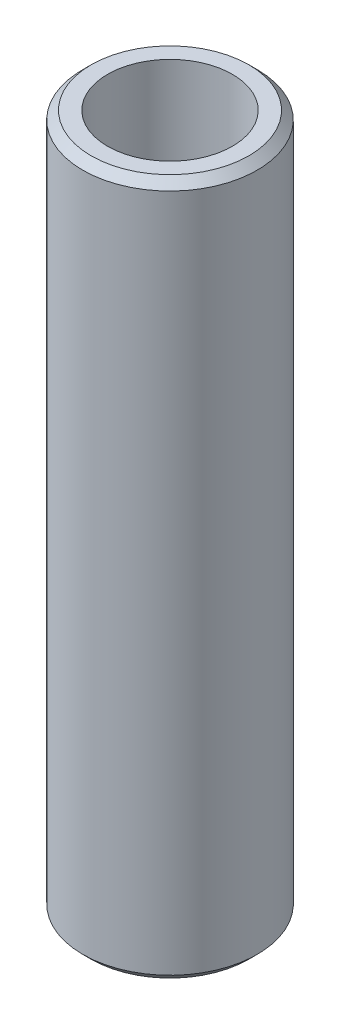
ISO-10303-21;
HEADER;
FILE_DESCRIPTION(('STEP AP214'),'2;1');
FILE_NAME('part.step','',(''),(''),'','','');
FILE_SCHEMA(('AUTOMOTIVE_DESIGN { 1 0 10303 214 1 1 1 1 }'));
ENDSEC;
DATA;
#1=APPLICATION_CONTEXT('core data for automotive mechanical design processes');
#2=APPLICATION_PROTOCOL_DEFINITION('international standard','automotive_design',2000,#1);
#3=PRODUCT_CONTEXT('',#1,'mechanical');
#4=PRODUCT('Part','Part','',(#3));
#5=PRODUCT_RELATED_PRODUCT_CATEGORY('part','',(#4));
#6=PRODUCT_DEFINITION_FORMATION('','',#4);
#7=PRODUCT_DEFINITION_CONTEXT('part definition',#1,'design');
#8=PRODUCT_DEFINITION('design','',#6,#7);
#9=PRODUCT_DEFINITION_SHAPE('','',#8);
#10=(LENGTH_UNIT() NAMED_UNIT(*) SI_UNIT(.MILLI.,.METRE.));
#11=(NAMED_UNIT(*) PLANE_ANGLE_UNIT() SI_UNIT($,.RADIAN.));
#12=(NAMED_UNIT(*) SI_UNIT($,.STERADIAN.) SOLID_ANGLE_UNIT());
#13=UNCERTAINTY_MEASURE_WITH_UNIT(LENGTH_MEASURE(1.E-05),#10,'distance_accuracy_value','');
#14=(GEOMETRIC_REPRESENTATION_CONTEXT(3) GLOBAL_UNCERTAINTY_ASSIGNED_CONTEXT((#13)) GLOBAL_UNIT_ASSIGNED_CONTEXT((#10,
#11,#12)) REPRESENTATION_CONTEXT('',''));
#15=CARTESIAN_POINT('',(0.,0.,0.));
#16=DIRECTION('',(0.,0.,1.));
#17=DIRECTION('',(1.,0.,0.));
#18=AXIS2_PLACEMENT_3D('',#15,#16,#17);
#19=CARTESIAN_POINT('',(0.,259.335573330545,0.));
#20=DIRECTION('',(0.,-1.,0.));
#21=DIRECTION('',(0.,0.,-1.));
#22=AXIS2_PLACEMENT_3D('',#19,#20,#21);
#23=CYLINDRICAL_SURFACE('',#22,32.5);
#24=CARTESIAN_POINT('',(0.,256.236041932352,0.));
#25=DIRECTION('',(0.,1.,0.));
#26=DIRECTION('',(0.,0.,1.));
#27=AXIS2_PLACEMENT_3D('',#24,#25,#26);
#28=CIRCLE('',#27,32.5);
#29=CARTESIAN_POINT('',(0.,256.236041932352,-32.5));
#30=VERTEX_POINT('',#29);
#31=EDGE_CURVE('E50',#30,#30,#28,.F.);
#32=ORIENTED_EDGE('',*,*,#31,.T.);
#33=EDGE_LOOP('',(#32));
#34=FACE_BOUND('',#33,.T.);
#35=CARTESIAN_POINT('',(0.,3.09953139819297,0.));
#36=DIRECTION('',(0.,1.,0.));
#37=DIRECTION('',(0.,0.,1.));
#38=AXIS2_PLACEMENT_3D('',#35,#36,#37);
#39=CIRCLE('',#38,32.5);
#40=CARTESIAN_POINT('',(0.,3.09953139819297,32.5));
#41=VERTEX_POINT('',#40);
#42=EDGE_CURVE('E51',#41,#41,#39,.T.);
#43=ORIENTED_EDGE('',*,*,#42,.T.);
#44=EDGE_LOOP('',(#43));
#45=FACE_BOUND('',#44,.T.);
#46=ADVANCED_FACE('F39',(#34,#45),#23,.T.);
#47=CARTESIAN_POINT('',(0.,259.335573330545,0.));
#48=DIRECTION('',(0.,1.,0.));
#49=DIRECTION('',(0.,0.,1.));
#50=AXIS2_PLACEMENT_3D('',#47,#48,#49);
#51=PLANE('',#50);
#52=CARTESIAN_POINT('',(0.,259.335573330545,0.));
#53=DIRECTION('',(0.,1.,0.));
#54=DIRECTION('',(0.,0.,1.));
#55=AXIS2_PLACEMENT_3D('',#52,#53,#54);
#56=CIRCLE('',#55,29.400468601807);
#57=CARTESIAN_POINT('',(0.,259.335573330545,-29.400468601807));
#58=VERTEX_POINT('',#57);
#59=EDGE_CURVE('E54',#58,#58,#56,.T.);
#60=ORIENTED_EDGE('',*,*,#59,.T.);
#61=EDGE_LOOP('',(#60));
#62=FACE_BOUND('',#61,.T.);
#63=CARTESIAN_POINT('',(0.,259.335573330545,0.));
#64=DIRECTION('',(0.,1.,0.));
#65=DIRECTION('',(0.,0.,1.));
#66=AXIS2_PLACEMENT_3D('',#63,#64,#65);
#67=CIRCLE('',#66,23.255585100036);
#68=CARTESIAN_POINT('',(0.,259.335573330545,23.255585100036));
#69=VERTEX_POINT('',#68);
#70=EDGE_CURVE('E58',#69,#69,#67,.T.);
#71=ORIENTED_EDGE('',*,*,#70,.F.);
#72=EDGE_LOOP('',(#71));
#73=FACE_BOUND('',#72,.T.);
#74=ADVANCED_FACE('F69',(#62,#73),#51,.T.);
#75=CARTESIAN_POINT('',(0.,0.,0.));
#76=DIRECTION('',(0.,1.,0.));
#77=DIRECTION('',(0.,0.,1.));
#78=AXIS2_PLACEMENT_3D('',#75,#76,#77);
#79=PLANE('',#78);
#80=CARTESIAN_POINT('',(0.,0.,0.));
#81=DIRECTION('',(0.,1.,0.));
#82=DIRECTION('',(0.,0.,1.));
#83=AXIS2_PLACEMENT_3D('',#80,#81,#82);
#84=CIRCLE('',#83,29.400468601807);
#85=CARTESIAN_POINT('',(0.,0.,29.400468601807));
#86=VERTEX_POINT('',#85);
#87=EDGE_CURVE('E10',#86,#86,#84,.F.);
#88=ORIENTED_EDGE('',*,*,#87,.T.);
#89=EDGE_LOOP('',(#88));
#90=FACE_BOUND('',#89,.T.);
#91=CARTESIAN_POINT('',(0.,0.,0.));
#92=DIRECTION('',(0.,1.,0.));
#93=DIRECTION('',(0.,0.,1.));
#94=AXIS2_PLACEMENT_3D('',#91,#92,#93);
#95=CIRCLE('',#94,23.255585100036);
#96=CARTESIAN_POINT('',(0.,0.,23.255585100036));
#97=VERTEX_POINT('',#96);
#98=EDGE_CURVE('E63',#97,#97,#95,.T.);
#99=ORIENTED_EDGE('',*,*,#98,.T.);
#100=EDGE_LOOP('',(#99));
#101=FACE_BOUND('',#100,.T.);
#102=ADVANCED_FACE('F75',(#90,#101),#79,.F.);
#103=CARTESIAN_POINT('',(0.,259.335573330545,0.));
#104=DIRECTION('',(0.,-1.,0.));
#105=DIRECTION('',(0.,0.,-1.));
#106=AXIS2_PLACEMENT_3D('',#103,#104,#105);
#107=CYLINDRICAL_SURFACE('',#106,23.255585100036);
#108=ORIENTED_EDGE('',*,*,#70,.T.);
#109=EDGE_LOOP('',(#108));
#110=FACE_BOUND('',#109,.T.);
#111=ORIENTED_EDGE('',*,*,#98,.F.);
#112=EDGE_LOOP('',(#111));
#113=FACE_BOUND('',#112,.T.);
#114=ADVANCED_FACE('F70',(#110,#113),#107,.F.);
#115=CARTESIAN_POINT('',(0.,259.335573330545,0.));
#116=DIRECTION('',(0.,-1.,0.));
#117=DIRECTION('',(0.,0.,-1.));
#118=AXIS2_PLACEMENT_3D('',#115,#116,#117);
#119=CONICAL_SURFACE('',#118,29.400468601807,0.785398163397439);
#120=CARTESIAN_POINT('',(0.,256.236041932352,-32.5));
#121=CARTESIAN_POINT('',(0.,256.26832871775,-32.4677132146022));
#122=CARTESIAN_POINT('',(0.,256.300615503148,-32.4354264292043));
#123=CARTESIAN_POINT('',(0.,256.365189073944,-32.3708528584087));
#124=CARTESIAN_POINT('',(0.,256.397475859342,-32.3385660730108));
#125=CARTESIAN_POINT('',(0.,256.462049430137,-32.2739925022151));
#126=CARTESIAN_POINT('',(0.,256.494336215535,-32.2417057168173));
#127=CARTESIAN_POINT('',(0.,256.558909786331,-32.1771321460216));
#128=CARTESIAN_POINT('',(0.,256.591196571729,-32.1448453606237));
#129=CARTESIAN_POINT('',(0.,256.655770142524,-32.0802717898281));
#130=CARTESIAN_POINT('',(0.,256.688056927922,-32.0479850044302));
#131=CARTESIAN_POINT('',(0.,256.752630498718,-31.9834114336345));
#132=CARTESIAN_POINT('',(0.,256.784917284116,-31.9511246482367));
#133=CARTESIAN_POINT('',(0.,256.849490854911,-31.886551077441));
#134=CARTESIAN_POINT('',(0.,256.881777640309,-31.8542642920431));
#135=CARTESIAN_POINT('',(0.,256.946351211105,-31.7896907212475));
#136=CARTESIAN_POINT('',(0.,256.978637996503,-31.7574039358496));
#137=CARTESIAN_POINT('',(0.,257.043211567298,-31.6928303650539));
#138=CARTESIAN_POINT('',(0.,257.075498352696,-31.6605435796561));
#139=CARTESIAN_POINT('',(0.,257.140071923492,-31.5959700088604));
#140=CARTESIAN_POINT('',(0.,257.17235870889,-31.5636832234626));
#141=CARTESIAN_POINT('',(0.,257.236932279685,-31.4991096526669));
#142=CARTESIAN_POINT('',(0.,257.269219065083,-31.466822867269));
#143=CARTESIAN_POINT('',(0.,257.333792635879,-31.4022492964733));
#144=CARTESIAN_POINT('',(0.,257.366079421277,-31.3699625110755));
#145=CARTESIAN_POINT('',(0.,257.430652992073,-31.3053889402798));
#146=CARTESIAN_POINT('',(0.,257.46293977747,-31.273102154882));
#147=CARTESIAN_POINT('',(0.,257.527513348266,-31.2085285840863));
#148=CARTESIAN_POINT('',(0.,257.559800133664,-31.1762417986884));
#149=CARTESIAN_POINT('',(0.,257.62437370446,-31.1116682278927));
#150=CARTESIAN_POINT('',(0.,257.656660489857,-31.0793814424949));
#151=CARTESIAN_POINT('',(0.,257.721234060653,-31.0148078716992));
#152=CARTESIAN_POINT('',(0.,257.753520846051,-30.9825210863014));
#153=CARTESIAN_POINT('',(0.,257.818094416847,-30.9179475155057));
#154=CARTESIAN_POINT('',(0.,257.850381202245,-30.8856607301078));
#155=CARTESIAN_POINT('',(0.,257.91495477304,-30.8210871593121));
#156=CARTESIAN_POINT('',(0.,257.947241558438,-30.7888003739143));
#157=CARTESIAN_POINT('',(0.,258.011815129234,-30.7242268031186));
#158=CARTESIAN_POINT('',(0.,258.044101914632,-30.6919400177208));
#159=CARTESIAN_POINT('',(0.,258.108675485427,-30.6273664469251));
#160=CARTESIAN_POINT('',(0.,258.140962270825,-30.5950796615272));
#161=CARTESIAN_POINT('',(0.,258.205535841621,-30.5305060907315));
#162=CARTESIAN_POINT('',(0.,258.237822627019,-30.4982193053337));
#163=CARTESIAN_POINT('',(0.,258.302396197814,-30.433645734538));
#164=CARTESIAN_POINT('',(0.,258.334682983212,-30.4013589491402));
#165=CARTESIAN_POINT('',(0.,258.399256554008,-30.3367853783445));
#166=CARTESIAN_POINT('',(0.,258.431543339406,-30.3044985929466));
#167=CARTESIAN_POINT('',(0.,258.496116910201,-30.2399250221509));
#168=CARTESIAN_POINT('',(0.,258.528403695599,-30.2076382367531));
#169=CARTESIAN_POINT('',(0.,258.592977266395,-30.1430646659574));
#170=CARTESIAN_POINT('',(0.,258.625264051793,-30.1107778805596));
#171=CARTESIAN_POINT('',(0.,258.689837622589,-30.0462043097639));
#172=CARTESIAN_POINT('',(0.,258.722124407986,-30.013917524366));
#173=CARTESIAN_POINT('',(0.,258.786697978782,-29.9493439535703));
#174=CARTESIAN_POINT('',(0.,258.81898476418,-29.9170571681725));
#175=CARTESIAN_POINT('',(0.,258.883558334976,-29.8524835973768));
#176=CARTESIAN_POINT('',(0.,258.915845120373,-29.820196811979));
#177=CARTESIAN_POINT('',(0.,258.980418691169,-29.7556232411833));
#178=CARTESIAN_POINT('',(0.,259.012705476567,-29.7233364557854));
#179=CARTESIAN_POINT('',(0.,259.077279047363,-29.6587628849898));
#180=CARTESIAN_POINT('',(0.,259.10956583276,-29.6264760995919));
#181=CARTESIAN_POINT('',(0.,259.174139403556,-29.5619025287962));
#182=CARTESIAN_POINT('',(0.,259.206426188954,-29.5296157433984));
#183=CARTESIAN_POINT('',(0.,259.27099975975,-29.4650421726027));
#184=CARTESIAN_POINT('',(0.,259.303286545148,-29.4327553872048));
#185=CARTESIAN_POINT('',(0.,259.335573330545,-29.400468601807));
#186=B_SPLINE_CURVE_WITH_KNOTS('',3,(#120,#121,#122,#123,#124,#125,#126,#127,#128,#129,#130,
#131,#132,#133,#134,#135,#136,#137,#138,#139,#140,#141,#142,#143,#144,#145,#146,#147,#148,#149,
#150,#151,#152,#153,#154,#155,#156,#157,#158,#159,#160,#161,#162,#163,#164,#165,#166,#167,#168,
#169,#170,#171,#172,#173,#174,#175,#176,#177,#178,#179,#180,#181,#182,#183,#184,#185),
.UNSPECIFIED.,.F.,.F.,(4,2,2,2,2,2,2,2,2,2,2,2,2,2,2,2,2,2,2,2,2,2,2,2,2,2,2,2,2,2,2,2,4),(0.,
0.136981229385155,0.273962458770349,0.410943688155548,0.547924917540702,0.684906146925896,
0.821887376311095,0.95886860569625,1.09584983508144,1.23283106446664,1.36981229385179,
1.50679352323699,1.64377475262219,1.78075598200734,1.91773721139254,2.05471844077773,
2.19169967016293,2.32868089954808,2.46566212893328,2.60264335831847,2.73962458770363,
2.87660581708882,3.01358704647402,3.15056827585918,3.28754950524437,3.42453073462957,
3.56151196401472,3.69849319339992,3.83547442278511,3.97245565217027,4.10943688155546,
4.24641811094066,4.38339934032585),.UNSPECIFIED.);
#187=EDGE_CURVE('BSEAM81',#30,#58,#186,.T.);
#188=ORIENTED_EDGE('',*,*,#31,.F.);
#189=ORIENTED_EDGE('',*,*,#59,.F.);
#190=ORIENTED_EDGE('',*,*,#187,.T.);
#191=ORIENTED_EDGE('',*,*,#187,.F.);
#192=EDGE_LOOP('',(#188,#190,#189,#191));
#193=FACE_BOUND('',#192,.T.);
#194=ADVANCED_FACE('F81',(#193),#119,.T.);
#195=CARTESIAN_POINT('',(0.,3.09953139819297,0.));
#196=DIRECTION('',(0.,1.,0.));
#197=DIRECTION('',(0.,0.,1.));
#198=AXIS2_PLACEMENT_3D('',#195,#196,#197);
#199=CONICAL_SURFACE('',#198,32.5,0.785398163397453);
#200=ORIENTED_EDGE('',*,*,#87,.F.);
#201=EDGE_LOOP('',(#200));
#202=FACE_BOUND('',#201,.T.);
#203=ORIENTED_EDGE('',*,*,#42,.F.);
#204=EDGE_LOOP('',(#203));
#205=FACE_BOUND('',#204,.T.);
#206=ADVANCED_FACE('F45',(#202,#205),#199,.T.);
#207=CLOSED_SHELL('',(#46,#74,#102,#114,#194,#206));
#208=MANIFOLD_SOLID_BREP('B2',#207);
#209=ADVANCED_BREP_SHAPE_REPRESENTATION('',(#18,#208),#14);
#210=SHAPE_DEFINITION_REPRESENTATION(#9,#209);
ENDSEC;
END-ISO-10303-21;
